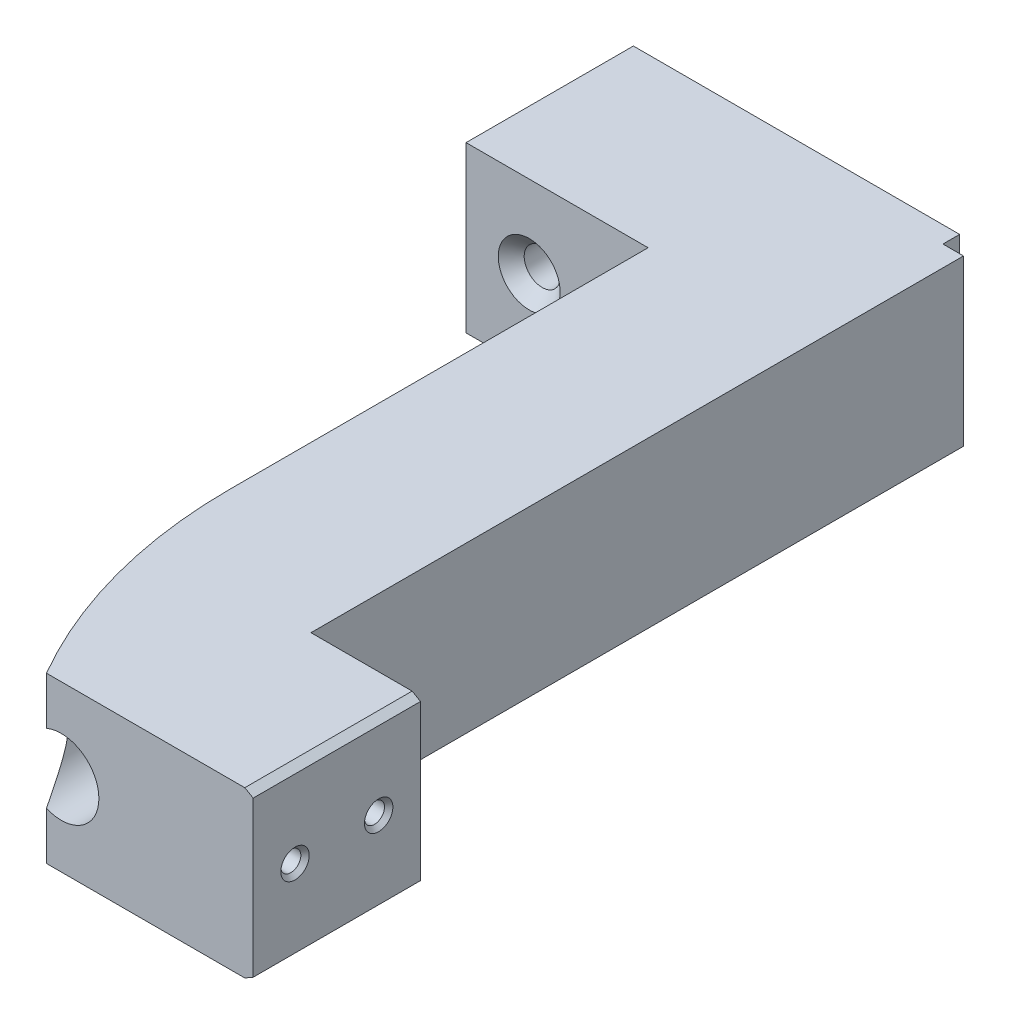
ISO-10303-21;
HEADER;
FILE_DESCRIPTION(('STEP AP214'),'2;1');
FILE_NAME('part.step','',(''),(''),'','','');
FILE_SCHEMA(('AUTOMOTIVE_DESIGN { 1 0 10303 214 1 1 1 1 }'));
ENDSEC;
DATA;
#1=APPLICATION_CONTEXT('core data for automotive mechanical design processes');
#2=APPLICATION_PROTOCOL_DEFINITION('international standard','automotive_design',2000,#1);
#3=PRODUCT_CONTEXT('',#1,'mechanical');
#4=PRODUCT('Part','Part','',(#3));
#5=PRODUCT_RELATED_PRODUCT_CATEGORY('part','',(#4));
#6=PRODUCT_DEFINITION_FORMATION('','',#4);
#7=PRODUCT_DEFINITION_CONTEXT('part definition',#1,'design');
#8=PRODUCT_DEFINITION('design','',#6,#7);
#9=PRODUCT_DEFINITION_SHAPE('','',#8);
#10=(LENGTH_UNIT() NAMED_UNIT(*) SI_UNIT(.MILLI.,.METRE.));
#11=(NAMED_UNIT(*) PLANE_ANGLE_UNIT() SI_UNIT($,.RADIAN.));
#12=(NAMED_UNIT(*) SI_UNIT($,.STERADIAN.) SOLID_ANGLE_UNIT());
#13=UNCERTAINTY_MEASURE_WITH_UNIT(LENGTH_MEASURE(1.E-05),#10,'distance_accuracy_value','');
#14=(GEOMETRIC_REPRESENTATION_CONTEXT(3) GLOBAL_UNCERTAINTY_ASSIGNED_CONTEXT((#13)) GLOBAL_UNIT_ASSIGNED_CONTEXT((#10,
#11,#12)) REPRESENTATION_CONTEXT('',''));
#15=CARTESIAN_POINT('',(0.,0.,0.));
#16=DIRECTION('',(0.,0.,1.));
#17=DIRECTION('',(1.,0.,0.));
#18=AXIS2_PLACEMENT_3D('',#15,#16,#17);
#19=CARTESIAN_POINT('',(41.4630883490828,0.,100.));
#20=DIRECTION('',(-1.,0.,0.));
#21=DIRECTION('',(0.,0.,1.));
#22=AXIS2_PLACEMENT_3D('',#19,#20,#21);
#23=PLANE('',#22);
#24=DIRECTION('',(0.,1.,0.));
#25=VECTOR('',#24,1.);
#26=CARTESIAN_POINT('',(41.4630883490828,19.7,80.));
#27=LINE('',#26,#25);
#28=CARTESIAN_POINT('',(41.4630883490828,0.,80.));
#29=VERTEX_POINT('',#28);
#30=CARTESIAN_POINT('',(41.4630883490828,19.7,80.));
#31=VERTEX_POINT('',#30);
#32=EDGE_CURVE('E171',#29,#31,#27,.T.);
#33=ORIENTED_EDGE('',*,*,#32,.F.);
#34=DIRECTION('',(0.,0.,-1.));
#35=VECTOR('',#34,1.);
#36=CARTESIAN_POINT('',(41.4630883490828,0.,100.));
#37=LINE('',#36,#35);
#38=CARTESIAN_POINT('',(41.4630883490828,0.,2.));
#39=VERTEX_POINT('',#38);
#40=EDGE_CURVE('E351',#29,#39,#37,.T.);
#41=ORIENTED_EDGE('',*,*,#40,.T.);
#42=DIRECTION('',(0.,-1.,0.));
#43=VECTOR('',#42,1.);
#44=CARTESIAN_POINT('',(41.4630883490828,19.7,2.));
#45=LINE('',#44,#43);
#46=CARTESIAN_POINT('',(41.4630883490828,19.7,2.));
#47=VERTEX_POINT('',#46);
#48=EDGE_CURVE('E374',#47,#39,#45,.T.);
#49=ORIENTED_EDGE('',*,*,#48,.F.);
#50=DIRECTION('',(0.,0.,-1.));
#51=VECTOR('',#50,1.);
#52=CARTESIAN_POINT('',(41.4630883490828,19.7,100.));
#53=LINE('',#52,#51);
#54=EDGE_CURVE('E353',#31,#47,#53,.T.);
#55=ORIENTED_EDGE('',*,*,#54,.F.);
#56=EDGE_LOOP('',(#33,#41,#49,#55));
#57=FACE_BOUND('',#56,.T.);
#58=ADVANCED_FACE('F38',(#57),#23,.F.);
#59=CARTESIAN_POINT('',(39.,0.,20.));
#60=DIRECTION('',(-1.,0.,0.));
#61=DIRECTION('',(0.,0.,1.));
#62=AXIS2_PLACEMENT_3D('',#59,#60,#61);
#63=PLANE('',#62);
#64=DIRECTION('',(0.,1.,0.));
#65=VECTOR('',#64,1.);
#66=CARTESIAN_POINT('',(39.,19.7,2.));
#67=LINE('',#66,#65);
#68=CARTESIAN_POINT('',(39.,0.,2.));
#69=VERTEX_POINT('',#68);
#70=CARTESIAN_POINT('',(39.,19.7,2.));
#71=VERTEX_POINT('',#70);
#72=EDGE_CURVE('E202',#69,#71,#67,.T.);
#73=ORIENTED_EDGE('',*,*,#72,.F.);
#74=DIRECTION('',(0.,0.,-1.));
#75=VECTOR('',#74,1.);
#76=CARTESIAN_POINT('',(39.,0.,20.));
#77=LINE('',#76,#75);
#78=CARTESIAN_POINT('',(39.,0.,0.));
#79=VERTEX_POINT('',#78);
#80=EDGE_CURVE('E307',#69,#79,#77,.T.);
#81=ORIENTED_EDGE('',*,*,#80,.T.);
#82=DIRECTION('',(0.,1.,0.));
#83=VECTOR('',#82,1.);
#84=CARTESIAN_POINT('',(39.,0.,0.));
#85=LINE('',#84,#83);
#86=CARTESIAN_POINT('',(39.,19.7,0.));
#87=VERTEX_POINT('',#86);
#88=EDGE_CURVE('E318',#79,#87,#85,.T.);
#89=ORIENTED_EDGE('',*,*,#88,.T.);
#90=DIRECTION('',(0.,0.,-1.));
#91=VECTOR('',#90,1.);
#92=CARTESIAN_POINT('',(39.,19.7,20.));
#93=LINE('',#92,#91);
#94=EDGE_CURVE('E309',#71,#87,#93,.T.);
#95=ORIENTED_EDGE('',*,*,#94,.F.);
#96=EDGE_LOOP('',(#73,#81,#89,#95));
#97=FACE_BOUND('',#96,.T.);
#98=ADVANCED_FACE('F227',(#97),#63,.F.);
#99=CARTESIAN_POINT('',(0.,0.,20.));
#100=DIRECTION('',(0.,0.,-1.));
#101=DIRECTION('',(-1.,0.,0.));
#102=AXIS2_PLACEMENT_3D('',#99,#100,#101);
#103=PLANE('',#102);
#104=CARTESIAN_POINT('',(7.55,9.85,20.));
#105=DIRECTION('',(0.,0.,1.));
#106=DIRECTION('',(1.,0.,0.));
#107=AXIS2_PLACEMENT_3D('',#104,#105,#106);
#108=CIRCLE('',#107,3.7);
#109=CARTESIAN_POINT('',(11.25,9.85,20.));
#110=VERTEX_POINT('',#109);
#111=EDGE_CURVE('E348',#110,#110,#108,.T.);
#112=ORIENTED_EDGE('',*,*,#111,.F.);
#113=EDGE_LOOP('',(#112));
#114=FACE_BOUND('',#113,.T.);
#115=DIRECTION('',(1.,0.,0.));
#116=VECTOR('',#115,1.);
#117=CARTESIAN_POINT('',(0.,0.,20.));
#118=LINE('',#117,#116);
#119=CARTESIAN_POINT('',(0.,0.,20.));
#120=VERTEX_POINT('',#119);
#121=CARTESIAN_POINT('',(21.7630883490828,0.,20.));
#122=VERTEX_POINT('',#121);
#123=EDGE_CURVE('E329',#120,#122,#118,.T.);
#124=ORIENTED_EDGE('',*,*,#123,.T.);
#125=DIRECTION('',(0.,1.,0.));
#126=VECTOR('',#125,1.);
#127=CARTESIAN_POINT('',(21.7630883490828,0.,20.));
#128=LINE('',#127,#126);
#129=CARTESIAN_POINT('',(21.7630883490828,19.7,20.));
#130=VERTEX_POINT('',#129);
#131=EDGE_CURVE('E364',#122,#130,#128,.T.);
#132=ORIENTED_EDGE('',*,*,#131,.T.);
#133=DIRECTION('',(-1.,0.,0.));
#134=VECTOR('',#133,1.);
#135=CARTESIAN_POINT('',(0.,19.7,20.));
#136=LINE('',#135,#134);
#137=CARTESIAN_POINT('',(0.,19.7,20.));
#138=VERTEX_POINT('',#137);
#139=EDGE_CURVE('E314',#130,#138,#136,.T.);
#140=ORIENTED_EDGE('',*,*,#139,.T.);
#141=DIRECTION('',(0.,-1.,0.));
#142=VECTOR('',#141,1.);
#143=CARTESIAN_POINT('',(0.,0.,20.));
#144=LINE('',#143,#142);
#145=EDGE_CURVE('E317',#138,#120,#144,.T.);
#146=ORIENTED_EDGE('',*,*,#145,.T.);
#147=EDGE_LOOP('',(#124,#132,#140,#146));
#148=FACE_BOUND('',#147,.T.);
#149=ADVANCED_FACE('F233',(#114,#148),#103,.F.);
#150=CARTESIAN_POINT('',(31.6130883490828,9.85,20.));
#151=DIRECTION('',(0.,0.,1.));
#152=DIRECTION('',(1.,0.,0.));
#153=AXIS2_PLACEMENT_3D('',#150,#151,#152);
#154=CIRCLE('',#153,3.7);
#155=CARTESIAN_POINT('',(35.3130883490828,9.85,20.));
#156=VERTEX_POINT('',#155);
#157=EDGE_CURVE('E339',#156,#156,#154,.T.);
#158=ORIENTED_EDGE('',*,*,#157,.F.);
#159=EDGE_LOOP('',(#158));
#160=FACE_BOUND('',#159,.T.);
#161=CARTESIAN_POINT('',(31.6130883490828,9.85,20.));
#162=DIRECTION('',(0.,0.,1.));
#163=DIRECTION('',(1.,0.,0.));
#164=AXIS2_PLACEMENT_3D('',#161,#162,#163);
#165=CIRCLE('',#164,4.5);
#166=CARTESIAN_POINT('',(36.1130883490828,9.85,20.));
#167=VERTEX_POINT('',#166);
#168=EDGE_CURVE('E360',#167,#167,#165,.T.);
#169=ORIENTED_EDGE('',*,*,#168,.T.);
#170=EDGE_LOOP('',(#169));
#171=FACE_BOUND('',#170,.T.);
#172=ADVANCED_FACE('F257',(#160,#171),#103,.F.);
#173=CARTESIAN_POINT('',(0.,0.,20.));
#174=DIRECTION('',(1.,0.,0.));
#175=DIRECTION('',(0.,0.,-1.));
#176=AXIS2_PLACEMENT_3D('',#173,#174,#175);
#177=PLANE('',#176);
#178=DIRECTION('',(0.,-1.,0.));
#179=VECTOR('',#178,1.);
#180=CARTESIAN_POINT('',(0.,0.,0.));
#181=LINE('',#180,#179);
#182=CARTESIAN_POINT('',(0.,19.7,0.));
#183=VERTEX_POINT('',#182);
#184=CARTESIAN_POINT('',(0.,0.,0.));
#185=VERTEX_POINT('',#184);
#186=EDGE_CURVE('E324',#183,#185,#181,.T.);
#187=ORIENTED_EDGE('',*,*,#186,.T.);
#188=DIRECTION('',(0.,0.,-1.));
#189=VECTOR('',#188,1.);
#190=CARTESIAN_POINT('',(0.,0.,20.));
#191=LINE('',#190,#189);
#192=EDGE_CURVE('E304',#120,#185,#191,.T.);
#193=ORIENTED_EDGE('',*,*,#192,.F.);
#194=ORIENTED_EDGE('',*,*,#145,.F.);
#195=DIRECTION('',(0.,0.,-1.));
#196=VECTOR('',#195,1.);
#197=CARTESIAN_POINT('',(0.,19.7,20.));
#198=LINE('',#197,#196);
#199=EDGE_CURVE('E311',#138,#183,#198,.T.);
#200=ORIENTED_EDGE('',*,*,#199,.T.);
#201=EDGE_LOOP('',(#187,#193,#194,#200));
#202=FACE_BOUND('',#201,.T.);
#203=ADVANCED_FACE('F269',(#202),#177,.F.);
#204=CARTESIAN_POINT('',(0.,0.,20.));
#205=DIRECTION('',(0.,1.,0.));
#206=DIRECTION('',(0.,0.,1.));
#207=AXIS2_PLACEMENT_3D('',#204,#205,#206);
#208=PLANE('',#207);
#209=DIRECTION('',(-1.,0.,0.));
#210=VECTOR('',#209,1.);
#211=CARTESIAN_POINT('',(54.5530883490828,0.,80.));
#212=LINE('',#211,#210);
#213=CARTESIAN_POINT('',(53.5530883490828,0.,80.));
#214=VERTEX_POINT('',#213);
#215=EDGE_CURVE('E182',#214,#29,#212,.T.);
#216=ORIENTED_EDGE('',*,*,#215,.F.);
#217=DIRECTION('',(0.,0.,1.));
#218=VECTOR('',#217,1.);
#219=CARTESIAN_POINT('',(53.5530883490828,0.,100.));
#220=LINE('',#219,#218);
#221=CARTESIAN_POINT('',(53.5530883490828,0.,100.));
#222=VERTEX_POINT('',#221);
#223=EDGE_CURVE('E62',#214,#222,#220,.T.);
#224=ORIENTED_EDGE('',*,*,#223,.T.);
#225=DIRECTION('',(1.,0.,0.));
#226=VECTOR('',#225,1.);
#227=CARTESIAN_POINT('',(0.,0.,100.));
#228=LINE('',#227,#226);
#229=CARTESIAN_POINT('',(29.8482648969,0.,100.));
#230=VERTEX_POINT('',#229);
#231=EDGE_CURVE('E363',#230,#222,#228,.T.);
#232=ORIENTED_EDGE('',*,*,#231,.F.);
#233=CARTESIAN_POINT('',(81.4630883490828,0.,70.));
#234=DIRECTION('',(0.,-1.,0.));
#235=DIRECTION('',(0.,0.,1.));
#236=AXIS2_PLACEMENT_3D('',#233,#234,#235);
#237=CIRCLE('',#236,59.7);
#238=CARTESIAN_POINT('',(21.7630883490828,0.,70.));
#239=VERTEX_POINT('',#238);
#240=EDGE_CURVE('E185',#230,#239,#237,.T.);
#241=ORIENTED_EDGE('',*,*,#240,.T.);
#242=DIRECTION('',(0.,0.,-1.));
#243=VECTOR('',#242,1.);
#244=CARTESIAN_POINT('',(21.7630883490828,0.,100.));
#245=LINE('',#244,#243);
#246=EDGE_CURVE('E357',#239,#122,#245,.T.);
#247=ORIENTED_EDGE('',*,*,#246,.T.);
#248=ORIENTED_EDGE('',*,*,#123,.F.);
#249=ORIENTED_EDGE('',*,*,#192,.T.);
#250=DIRECTION('',(1.,0.,0.));
#251=VECTOR('',#250,1.);
#252=CARTESIAN_POINT('',(0.,0.,0.));
#253=LINE('',#252,#251);
#254=EDGE_CURVE('E321',#185,#79,#253,.T.);
#255=ORIENTED_EDGE('',*,*,#254,.T.);
#256=ORIENTED_EDGE('',*,*,#80,.F.);
#257=DIRECTION('',(-1.,0.,0.));
#258=VECTOR('',#257,1.);
#259=CARTESIAN_POINT('',(39.,0.,2.));
#260=LINE('',#259,#258);
#261=EDGE_CURVE('E367',#39,#69,#260,.T.);
#262=ORIENTED_EDGE('',*,*,#261,.F.);
#263=ORIENTED_EDGE('',*,*,#40,.F.);
#264=EDGE_LOOP('',(#216,#224,#232,#241,#247,#248,#249,#255,#256,#262,#263));
#265=FACE_BOUND('',#264,.T.);
#266=ADVANCED_FACE('F264',(#265),#208,.F.);
#267=CARTESIAN_POINT('',(0.,19.7,20.));
#268=DIRECTION('',(0.,-1.,0.));
#269=DIRECTION('',(0.,0.,-1.));
#270=AXIS2_PLACEMENT_3D('',#267,#268,#269);
#271=PLANE('',#270);
#272=DIRECTION('',(-1.,0.,0.));
#273=VECTOR('',#272,1.);
#274=CARTESIAN_POINT('',(0.,19.7,100.));
#275=LINE('',#274,#273);
#276=CARTESIAN_POINT('',(53.5530883490828,19.7,100.));
#277=VERTEX_POINT('',#276);
#278=CARTESIAN_POINT('',(29.8482648969,19.7,100.));
#279=VERTEX_POINT('',#278);
#280=EDGE_CURVE('E370',#277,#279,#275,.T.);
#281=ORIENTED_EDGE('',*,*,#280,.F.);
#282=DIRECTION('',(0.,0.,-1.));
#283=VECTOR('',#282,1.);
#284=CARTESIAN_POINT('',(53.5530883490828,19.7,80.));
#285=LINE('',#284,#283);
#286=CARTESIAN_POINT('',(53.5530883490828,19.7,80.));
#287=VERTEX_POINT('',#286);
#288=EDGE_CURVE('E11',#277,#287,#285,.T.);
#289=ORIENTED_EDGE('',*,*,#288,.T.);
#290=DIRECTION('',(-1.,0.,0.));
#291=VECTOR('',#290,1.);
#292=CARTESIAN_POINT('',(54.5530883490828,19.7,80.));
#293=LINE('',#292,#291);
#294=EDGE_CURVE('E178',#287,#31,#293,.T.);
#295=ORIENTED_EDGE('',*,*,#294,.T.);
#296=ORIENTED_EDGE('',*,*,#54,.T.);
#297=DIRECTION('',(1.,0.,0.));
#298=VECTOR('',#297,1.);
#299=CARTESIAN_POINT('',(39.,19.7,2.));
#300=LINE('',#299,#298);
#301=EDGE_CURVE('E376',#71,#47,#300,.T.);
#302=ORIENTED_EDGE('',*,*,#301,.F.);
#303=ORIENTED_EDGE('',*,*,#94,.T.);
#304=DIRECTION('',(-1.,0.,0.));
#305=VECTOR('',#304,1.);
#306=CARTESIAN_POINT('',(0.,19.7,0.));
#307=LINE('',#306,#305);
#308=EDGE_CURVE('E315',#87,#183,#307,.T.);
#309=ORIENTED_EDGE('',*,*,#308,.T.);
#310=ORIENTED_EDGE('',*,*,#199,.F.);
#311=ORIENTED_EDGE('',*,*,#139,.F.);
#312=DIRECTION('',(0.,0.,-1.));
#313=VECTOR('',#312,1.);
#314=CARTESIAN_POINT('',(21.7630883490828,19.7,100.));
#315=LINE('',#314,#313);
#316=CARTESIAN_POINT('',(21.7630883490828,19.7,70.));
#317=VERTEX_POINT('',#316);
#318=EDGE_CURVE('E355',#317,#130,#315,.T.);
#319=ORIENTED_EDGE('',*,*,#318,.F.);
#320=CARTESIAN_POINT('',(81.4630883490828,19.7,70.));
#321=DIRECTION('',(0.,-1.,0.));
#322=DIRECTION('',(0.,0.,1.));
#323=AXIS2_PLACEMENT_3D('',#320,#321,#322);
#324=CIRCLE('',#323,59.7);
#325=EDGE_CURVE('E184',#279,#317,#324,.T.);
#326=ORIENTED_EDGE('',*,*,#325,.F.);
#327=EDGE_LOOP('',(#281,#289,#295,#296,#302,#303,#309,#310,#311,#319,#326));
#328=FACE_BOUND('',#327,.T.);
#329=ADVANCED_FACE('F261',(#328),#271,.F.);
#330=CARTESIAN_POINT('',(0.,0.,0.));
#331=DIRECTION('',(0.,0.,-1.));
#332=DIRECTION('',(-1.,0.,0.));
#333=AXIS2_PLACEMENT_3D('',#330,#331,#332);
#334=PLANE('',#333);
#335=CARTESIAN_POINT('',(7.55,9.85,0.));
#336=DIRECTION('',(0.,0.,-1.));
#337=DIRECTION('',(-1.,0.,0.));
#338=AXIS2_PLACEMENT_3D('',#335,#336,#337);
#339=CIRCLE('',#338,2.14999999999999);
#340=CARTESIAN_POINT('',(5.40000000000001,9.85,0.));
#341=VERTEX_POINT('',#340);
#342=EDGE_CURVE('E342',#341,#341,#339,.T.);
#343=ORIENTED_EDGE('',*,*,#342,.F.);
#344=EDGE_LOOP('',(#343));
#345=FACE_BOUND('',#344,.T.);
#346=CARTESIAN_POINT('',(31.6130883490828,9.85,0.));
#347=DIRECTION('',(0.,0.,-1.));
#348=DIRECTION('',(-1.,0.,0.));
#349=AXIS2_PLACEMENT_3D('',#346,#347,#348);
#350=CIRCLE('',#349,2.14999999999999);
#351=CARTESIAN_POINT('',(29.4630883490828,9.85,0.));
#352=VERTEX_POINT('',#351);
#353=EDGE_CURVE('E327',#352,#352,#350,.T.);
#354=ORIENTED_EDGE('',*,*,#353,.F.);
#355=EDGE_LOOP('',(#354));
#356=FACE_BOUND('',#355,.T.);
#357=ORIENTED_EDGE('',*,*,#186,.F.);
#358=ORIENTED_EDGE('',*,*,#308,.F.);
#359=ORIENTED_EDGE('',*,*,#88,.F.);
#360=ORIENTED_EDGE('',*,*,#254,.F.);
#361=EDGE_LOOP('',(#357,#358,#359,#360));
#362=FACE_BOUND('',#361,.T.);
#363=ADVANCED_FACE('F253',(#345,#356,#362),#334,.T.);
#364=CARTESIAN_POINT('',(31.6130883490828,9.85,20.));
#365=DIRECTION('',(0.,0.,1.));
#366=DIRECTION('',(1.,0.,0.));
#367=AXIS2_PLACEMENT_3D('',#364,#365,#366);
#368=CYLINDRICAL_SURFACE('',#367,2.14999999999999);
#369=CARTESIAN_POINT('',(31.6130883490828,9.85,18.45));
#370=DIRECTION('',(0.,0.,1.));
#371=DIRECTION('',(1.,0.,0.));
#372=AXIS2_PLACEMENT_3D('',#369,#370,#371);
#373=CIRCLE('',#372,2.14999999999999);
#374=CARTESIAN_POINT('',(33.7630883490828,9.85,18.45));
#375=VERTEX_POINT('',#374);
#376=EDGE_CURVE('E336',#375,#375,#373,.T.);
#377=ORIENTED_EDGE('',*,*,#376,.T.);
#378=EDGE_LOOP('',(#377));
#379=FACE_BOUND('',#378,.T.);
#380=ORIENTED_EDGE('',*,*,#353,.T.);
#381=EDGE_LOOP('',(#380));
#382=FACE_BOUND('',#381,.T.);
#383=ADVANCED_FACE('F249',(#379,#382),#368,.F.);
#384=CARTESIAN_POINT('',(31.6130883490828,9.85,20.));
#385=DIRECTION('',(0.,0.,1.));
#386=DIRECTION('',(1.,0.,0.));
#387=AXIS2_PLACEMENT_3D('',#384,#385,#386);
#388=CONICAL_SURFACE('',#387,3.7,0.785398163397447);
#389=ORIENTED_EDGE('',*,*,#376,.F.);
#390=EDGE_LOOP('',(#389));
#391=FACE_BOUND('',#390,.T.);
#392=ORIENTED_EDGE('',*,*,#157,.T.);
#393=EDGE_LOOP('',(#392));
#394=FACE_BOUND('',#393,.T.);
#395=ADVANCED_FACE('F245',(#391,#394),#388,.F.);
#396=CARTESIAN_POINT('',(7.55,9.85,20.));
#397=DIRECTION('',(0.,0.,1.));
#398=DIRECTION('',(1.,0.,0.));
#399=AXIS2_PLACEMENT_3D('',#396,#397,#398);
#400=CYLINDRICAL_SURFACE('',#399,2.14999999999999);
#401=CARTESIAN_POINT('',(7.55,9.85,18.45));
#402=DIRECTION('',(0.,0.,1.));
#403=DIRECTION('',(1.,0.,0.));
#404=AXIS2_PLACEMENT_3D('',#401,#402,#403);
#405=CIRCLE('',#404,2.14999999999999);
#406=CARTESIAN_POINT('',(9.69999999999999,9.85,18.45));
#407=VERTEX_POINT('',#406);
#408=EDGE_CURVE('E345',#407,#407,#405,.T.);
#409=ORIENTED_EDGE('',*,*,#408,.T.);
#410=EDGE_LOOP('',(#409));
#411=FACE_BOUND('',#410,.T.);
#412=ORIENTED_EDGE('',*,*,#342,.T.);
#413=EDGE_LOOP('',(#412));
#414=FACE_BOUND('',#413,.T.);
#415=ADVANCED_FACE('F241',(#411,#414),#400,.F.);
#416=CARTESIAN_POINT('',(7.55,9.85,20.));
#417=DIRECTION('',(0.,0.,1.));
#418=DIRECTION('',(1.,0.,0.));
#419=AXIS2_PLACEMENT_3D('',#416,#417,#418);
#420=CONICAL_SURFACE('',#419,3.7,0.785398163397447);
#421=ORIENTED_EDGE('',*,*,#408,.F.);
#422=EDGE_LOOP('',(#421));
#423=FACE_BOUND('',#422,.T.);
#424=ORIENTED_EDGE('',*,*,#111,.T.);
#425=EDGE_LOOP('',(#424));
#426=FACE_BOUND('',#425,.T.);
#427=ADVANCED_FACE('F238',(#423,#426),#420,.F.);
#428=CARTESIAN_POINT('',(21.7630883490828,0.,100.));
#429=DIRECTION('',(-1.,0.,0.));
#430=DIRECTION('',(0.,-1.,0.));
#431=AXIS2_PLACEMENT_3D('',#428,#429,#430);
#432=PLANE('',#431);
#433=DIRECTION('',(0.,1.,0.));
#434=VECTOR('',#433,1.);
#435=CARTESIAN_POINT('',(21.7630883490828,0.,70.));
#436=LINE('',#435,#434);
#437=EDGE_CURVE('E188',#239,#317,#436,.T.);
#438=ORIENTED_EDGE('',*,*,#437,.T.);
#439=ORIENTED_EDGE('',*,*,#318,.T.);
#440=ORIENTED_EDGE('',*,*,#131,.F.);
#441=ORIENTED_EDGE('',*,*,#246,.F.);
#442=EDGE_LOOP('',(#438,#439,#440,#441));
#443=FACE_BOUND('',#442,.T.);
#444=ADVANCED_FACE('F224',(#443),#432,.T.);
#445=CARTESIAN_POINT('',(31.6130883490828,9.85,100.));
#446=DIRECTION('',(0.,0.,-1.));
#447=DIRECTION('',(-1.,0.,0.));
#448=AXIS2_PLACEMENT_3D('',#445,#446,#447);
#449=CYLINDRICAL_SURFACE('',#448,4.5);
#450=CARTESIAN_POINT('',(29.8482648969,5.71050749697193,100.));
#451=CARTESIAN_POINT('',(29.7573327363336,5.7492915407916,99.8435552754339));
#452=CARTESIAN_POINT('',(29.6674409236068,5.79114176766117,99.6872563227438));
#453=CARTESIAN_POINT('',(29.4898253914112,5.88115816776018,99.3751956909919));
#454=CARTESIAN_POINT('',(29.4021021923884,5.92932583995793,99.2194341484741));
#455=CARTESIAN_POINT('',(29.2282246339589,6.03257590888257,98.9074589558449));
#456=CARTESIAN_POINT('',(29.1420897398109,6.08771318552003,98.751252567854));
#457=CARTESIAN_POINT('',(28.9723027890027,6.20488088465941,98.4400920503629));
#458=CARTESIAN_POINT('',(28.8886505399666,6.26691077128805,98.2851378245154));
#459=CARTESIAN_POINT('',(28.7193796971349,6.40198222782546,97.9682898151554));
#460=CARTESIAN_POINT('',(28.6339135927179,6.47544607504424,97.8064937345288));
#461=CARTESIAN_POINT('',(28.4662161839201,6.63125815418113,97.485529134678));
#462=CARTESIAN_POINT('',(28.3839844993272,6.71360533756157,97.3263603078997));
#463=CARTESIAN_POINT('',(28.2234043689128,6.88789912777069,97.0121652034036));
#464=CARTESIAN_POINT('',(28.1450437952242,6.97981252481124,96.8571267957874));
#465=CARTESIAN_POINT('',(27.9925113182906,7.17478901833796,96.5521448725778));
#466=CARTESIAN_POINT('',(27.9183368149126,7.27784507504326,96.4021982178754));
#467=CARTESIAN_POINT('',(27.8013576571921,7.45676902438222,96.1633200516963));
#468=CARTESIAN_POINT('',(27.7570350095204,7.52872552964363,96.0722011843658));
#469=CARTESIAN_POINT('',(27.6707330123241,7.67852229353251,95.8936735032703));
#470=CARTESIAN_POINT('',(27.6287544380072,7.75636447881049,95.806265919126));
#471=CARTESIAN_POINT('',(27.547942981744,7.91798230196027,95.6370010439462));
#472=CARTESIAN_POINT('',(27.5090878567034,8.00170617277274,95.5551053405366));
#473=CARTESIAN_POINT('',(27.4348276184277,8.17634137740738,95.3977283510213));
#474=CARTESIAN_POINT('',(27.3994199901016,8.26724738251887,95.322242393962));
#475=CARTESIAN_POINT('',(27.3295417793218,8.46670405630051,95.1725369611513));
#476=CARTESIAN_POINT('',(27.2955302221009,8.57610920691733,95.0992219459865));
#477=CARTESIAN_POINT('',(27.2344499816235,8.80523458861749,94.966980082151));
#478=CARTESIAN_POINT('',(27.2073761634249,8.92494710255227,94.9080425935674));
#479=CARTESIAN_POINT('',(27.1660948184226,9.15331107291617,94.8179078929222));
#480=CARTESIAN_POINT('',(27.1504993462804,9.26051320716756,94.7837336977656));
#481=CARTESIAN_POINT('',(27.1270011519775,9.47969808522657,94.7321744532177));
#482=CARTESIAN_POINT('',(27.1190896278567,9.5916752053654,94.7147701940513));
#483=CARTESIAN_POINT('',(27.1117775650123,9.81779595809533,94.6986863909995));
#484=CARTESIAN_POINT('',(27.1124151908843,9.93194703248659,94.700090811647));
#485=CARTESIAN_POINT('',(27.1222172442084,10.1580937449164,94.7216473779651));
#486=CARTESIAN_POINT('',(27.1313875657166,10.2700878384085,94.7418124827895));
#487=CARTESIAN_POINT('',(27.1595770442737,10.5080421275882,94.8036284545964));
#488=CARTESIAN_POINT('',(27.1800451437581,10.6329927377044,94.848435327978));
#489=CARTESIAN_POINT('',(27.2292597122891,10.8733215293115,94.9556661641982));
#490=CARTESIAN_POINT('',(27.2580220596402,10.9886807984308,95.0181239128091));
#491=CARTESIAN_POINT('',(27.3155020506295,11.1876303397287,95.1422478222525));
#492=CARTESIAN_POINT('',(27.3431113300617,11.2730009950482,95.2016440346989));
#493=CARTESIAN_POINT('',(27.401594416458,11.4377548075694,95.3268562670323));
#494=CARTESIAN_POINT('',(27.4324703622868,11.5171339828207,95.3926764908569));
#495=CARTESIAN_POINT('',(27.4969291960199,11.6704854238026,95.5293828491457));
#496=CARTESIAN_POINT('',(27.5305172664823,11.7444467968546,95.6002786516931));
#497=CARTESIAN_POINT('',(27.5999147928075,11.8873363530193,95.745971822588));
#498=CARTESIAN_POINT('',(27.6357251181799,11.9562625427386,95.820770716267));
#499=CARTESIAN_POINT('',(27.7461035489741,12.1564582135005,96.0500334254643));
#500=CARTESIAN_POINT('',(27.8235058814967,12.2808847902669,96.2091223350988));
#501=CARTESIAN_POINT('',(27.984103707863,12.5146879926519,96.535285717438));
#502=CARTESIAN_POINT('',(28.067305018983,12.624049168333,96.7023681546488));
#503=CARTESIAN_POINT('',(28.2387247566534,12.8302159168065,97.0424387627452));
#504=CARTESIAN_POINT('',(28.3269582797465,12.9269805056485,97.2154440064317));
#505=CARTESIAN_POINT('',(28.5075137432614,13.1091154024648,97.5651200569947));
#506=CARTESIAN_POINT('',(28.5998339943127,13.1944903611707,97.7417893334752));
#507=CARTESIAN_POINT('',(28.7845880221157,13.3519630993275,98.0909795101427));
#508=CARTESIAN_POINT('',(28.8768836995535,13.4244425815519,98.2634023199366));
#509=CARTESIAN_POINT('',(29.0646441117961,13.5606439761076,98.6099965420983));
#510=CARTESIAN_POINT('',(29.1601092942212,13.6243646448679,98.7841681990072));
#511=CARTESIAN_POINT('',(29.3528267023257,13.7427967380289,99.1315910758218));
#512=CARTESIAN_POINT('',(29.4500436761449,13.7976072082317,99.3048282119902));
#513=CARTESIAN_POINT('',(29.6471672056533,13.8993698039777,99.6519852826469));
#514=CARTESIAN_POINT('',(29.7470726888689,13.9463250106639,99.825904921905));
#515=CARTESIAN_POINT('',(29.8482648969,13.9894925030281,100.));
#516=B_SPLINE_CURVE_WITH_KNOTS('',3,(#450,#451,#452,#453,#454,#455,#456,#457,#458,#459,#460,
#461,#462,#463,#464,#465,#466,#467,#468,#469,#470,#471,#472,#473,#474,#475,#476,#477,#478,#479,
#480,#481,#482,#483,#484,#485,#486,#487,#488,#489,#490,#491,#492,#493,#494,#495,#496,#497,#498,
#499,#500,#501,#502,#503,#504,#505,#506,#507,#508,#509,#510,#511,#512,#513,#514,#515),
.UNSPECIFIED.,.F.,.F.,(4,2,2,2,2,2,2,2,2,2,2,2,2,2,2,2,2,2,2,2,2,2,2,2,2,2,2,2,2,2,2,2,4),(0.,
0.555168391350228,1.11046874908873,1.67045136382442,2.2303904725393,2.8217066787929,
3.41295316570818,4.00221154694249,4.59109979438234,4.96375761263321,5.33653795129814,
5.70637152204132,6.07593322991741,6.48296617143082,6.88969697312685,7.22909999540423,
7.56811377146598,7.90864145419468,8.24940453503838,8.65012170622785,9.05161115183221,
9.37397400146308,9.6965492414016,10.0197561755412,10.343090379268,10.9908686690053,
11.6393064030024,12.2898037823468,12.9400347255226,13.5655136206015,14.1910812292628,
14.8091327718262,15.4269413189816),.UNSPECIFIED.);
#517=CARTESIAN_POINT('',(29.8482648969,5.71050749697193,100.));
#518=VERTEX_POINT('',#517);
#519=CARTESIAN_POINT('',(29.8482648969,13.9894925030281,100.));
#520=VERTEX_POINT('',#519);
#521=EDGE_CURVE('E192',#518,#520,#516,.T.);
#522=ORIENTED_EDGE('',*,*,#521,.F.);
#523=CARTESIAN_POINT('',(31.6130883490828,9.85,100.));
#524=DIRECTION('',(0.,0.,1.));
#525=DIRECTION('',(1.,0.,0.));
#526=AXIS2_PLACEMENT_3D('',#523,#524,#525);
#527=CIRCLE('',#526,4.5);
#528=EDGE_CURVE('E359',#518,#520,#527,.T.);
#529=ORIENTED_EDGE('',*,*,#528,.T.);
#530=EDGE_LOOP('',(#522,#529));
#531=FACE_BOUND('',#530,.T.);
#532=ORIENTED_EDGE('',*,*,#168,.F.);
#533=EDGE_LOOP('',(#532));
#534=FACE_BOUND('',#533,.T.);
#535=ADVANCED_FACE('F204',(#531,#534),#449,.F.);
#536=CARTESIAN_POINT('',(0.,0.,100.));
#537=DIRECTION('',(0.,0.,1.));
#538=DIRECTION('',(1.,0.,0.));
#539=AXIS2_PLACEMENT_3D('',#536,#537,#538);
#540=PLANE('',#539);
#541=ORIENTED_EDGE('',*,*,#231,.T.);
#542=DIRECTION('',(0.866025403784442,0.499999999999995,0.));
#543=VECTOR('',#542,1.);
#544=CARTESIAN_POINT('',(13.3882720872704,-23.1891674807089,100.));
#545=LINE('',#544,#543);
#546=CARTESIAN_POINT('',(54.5530883490828,0.577350269189626,100.));
#547=VERTEX_POINT('',#546);
#548=EDGE_CURVE('E47',#222,#547,#545,.T.);
#549=ORIENTED_EDGE('',*,*,#548,.T.);
#550=DIRECTION('',(0.,-1.,0.));
#551=VECTOR('',#550,1.);
#552=CARTESIAN_POINT('',(54.5530883490828,19.7,100.));
#553=LINE('',#552,#551);
#554=CARTESIAN_POINT('',(54.5530883490828,19.1226497308104,100.));
#555=VERTEX_POINT('',#554);
#556=EDGE_CURVE('E172',#555,#547,#553,.T.);
#557=ORIENTED_EDGE('',*,*,#556,.F.);
#558=DIRECTION('',(-0.866025403784441,0.499999999999996,0.));
#559=VECTOR('',#558,1.);
#560=CARTESIAN_POINT('',(21.9186223145472,37.964167480709,100.));
#561=LINE('',#560,#559);
#562=EDGE_CURVE('E54',#555,#277,#561,.T.);
#563=ORIENTED_EDGE('',*,*,#562,.T.);
#564=ORIENTED_EDGE('',*,*,#280,.T.);
#565=DIRECTION('',(0.,1.,0.));
#566=VECTOR('',#565,1.);
#567=CARTESIAN_POINT('',(29.8482648969,0.,100.));
#568=LINE('',#567,#566);
#569=EDGE_CURVE('E301',#520,#279,#568,.T.);
#570=ORIENTED_EDGE('',*,*,#569,.F.);
#571=ORIENTED_EDGE('',*,*,#528,.F.);
#572=DIRECTION('',(0.,1.,0.));
#573=VECTOR('',#572,1.);
#574=CARTESIAN_POINT('',(29.8482648969,0.,100.));
#575=LINE('',#574,#573);
#576=EDGE_CURVE('E190',#230,#518,#575,.T.);
#577=ORIENTED_EDGE('',*,*,#576,.F.);
#578=EDGE_LOOP('',(#541,#549,#557,#563,#564,#570,#571,#577));
#579=FACE_BOUND('',#578,.T.);
#580=ADVANCED_FACE('F218',(#579),#540,.T.);
#581=CARTESIAN_POINT('',(0.,0.,2.));
#582=DIRECTION('',(0.,0.,1.));
#583=DIRECTION('',(1.,0.,0.));
#584=AXIS2_PLACEMENT_3D('',#581,#582,#583);
#585=PLANE('',#584);
#586=ORIENTED_EDGE('',*,*,#72,.T.);
#587=ORIENTED_EDGE('',*,*,#301,.T.);
#588=ORIENTED_EDGE('',*,*,#48,.T.);
#589=ORIENTED_EDGE('',*,*,#261,.T.);
#590=EDGE_LOOP('',(#586,#587,#588,#589));
#591=FACE_BOUND('',#590,.T.);
#592=ADVANCED_FACE('F214',(#591),#585,.F.);
#593=CARTESIAN_POINT('',(81.4630883490828,0.,70.));
#594=DIRECTION('',(0.,1.,0.));
#595=DIRECTION('',(0.,0.,1.));
#596=AXIS2_PLACEMENT_3D('',#593,#594,#595);
#597=CYLINDRICAL_SURFACE('',#596,59.7);
#598=ORIENTED_EDGE('',*,*,#521,.T.);
#599=ORIENTED_EDGE('',*,*,#569,.T.);
#600=ORIENTED_EDGE('',*,*,#325,.T.);
#601=ORIENTED_EDGE('',*,*,#437,.F.);
#602=ORIENTED_EDGE('',*,*,#240,.F.);
#603=ORIENTED_EDGE('',*,*,#576,.T.);
#604=EDGE_LOOP('',(#598,#599,#600,#601,#602,#603));
#605=FACE_BOUND('',#604,.T.);
#606=ADVANCED_FACE('F208',(#605),#597,.T.);
#607=CARTESIAN_POINT('',(54.5530883490828,19.7,80.));
#608=DIRECTION('',(0.,0.,1.));
#609=DIRECTION('',(1.,0.,0.));
#610=AXIS2_PLACEMENT_3D('',#607,#608,#609);
#611=PLANE('',#610);
#612=DIRECTION('',(0.,1.,0.));
#613=VECTOR('',#612,1.);
#614=CARTESIAN_POINT('',(54.5530883490828,19.7,80.));
#615=LINE('',#614,#613);
#616=CARTESIAN_POINT('',(54.5530883490828,0.577350269189626,80.));
#617=VERTEX_POINT('',#616);
#618=CARTESIAN_POINT('',(54.5530883490828,19.1226497308104,80.));
#619=VERTEX_POINT('',#618);
#620=EDGE_CURVE('E175',#617,#619,#615,.T.);
#621=ORIENTED_EDGE('',*,*,#620,.F.);
#622=DIRECTION('',(-0.866025403784442,-0.499999999999995,0.));
#623=VECTOR('',#622,1.);
#624=CARTESIAN_POINT('',(54.5530883490828,0.577350269189626,80.));
#625=LINE('',#624,#623);
#626=EDGE_CURVE('E293',#617,#214,#625,.T.);
#627=ORIENTED_EDGE('',*,*,#626,.T.);
#628=ORIENTED_EDGE('',*,*,#215,.T.);
#629=ORIENTED_EDGE('',*,*,#32,.T.);
#630=ORIENTED_EDGE('',*,*,#294,.F.);
#631=DIRECTION('',(0.866025403784441,-0.499999999999996,0.));
#632=VECTOR('',#631,1.);
#633=CARTESIAN_POINT('',(54.5530883490828,19.1226497308104,80.));
#634=LINE('',#633,#632);
#635=EDGE_CURVE('E295',#287,#619,#634,.T.);
#636=ORIENTED_EDGE('',*,*,#635,.T.);
#637=EDGE_LOOP('',(#621,#627,#628,#629,#630,#636));
#638=FACE_BOUND('',#637,.T.);
#639=ADVANCED_FACE('F213',(#638),#611,.F.);
#640=CARTESIAN_POINT('',(54.5530883490828,0.,0.));
#641=DIRECTION('',(1.,0.,0.));
#642=DIRECTION('',(0.,0.,-1.));
#643=AXIS2_PLACEMENT_3D('',#640,#641,#642);
#644=PLANE('',#643);
#645=CARTESIAN_POINT('',(54.5530883490828,9.85000000000001,95.));
#646=DIRECTION('',(1.,0.,0.));
#647=DIRECTION('',(0.,0.,-1.));
#648=AXIS2_PLACEMENT_3D('',#645,#646,#647);
#649=CIRCLE('',#648,1.7);
#650=CARTESIAN_POINT('',(54.5530883490828,9.85000000000001,93.3));
#651=VERTEX_POINT('',#650);
#652=EDGE_CURVE('E162',#651,#651,#649,.T.);
#653=ORIENTED_EDGE('',*,*,#652,.F.);
#654=EDGE_LOOP('',(#653));
#655=FACE_BOUND('',#654,.T.);
#656=CARTESIAN_POINT('',(54.5530883490828,9.85000000000001,85.));
#657=DIRECTION('',(1.,0.,0.));
#658=DIRECTION('',(0.,0.,-1.));
#659=AXIS2_PLACEMENT_3D('',#656,#657,#658);
#660=CIRCLE('',#659,1.7);
#661=CARTESIAN_POINT('',(54.5530883490828,9.85000000000001,83.3));
#662=VERTEX_POINT('',#661);
#663=EDGE_CURVE('E155',#662,#662,#660,.T.);
#664=ORIENTED_EDGE('',*,*,#663,.F.);
#665=EDGE_LOOP('',(#664));
#666=FACE_BOUND('',#665,.T.);
#667=ORIENTED_EDGE('',*,*,#556,.T.);
#668=DIRECTION('',(0.,0.,-1.));
#669=VECTOR('',#668,1.);
#670=CARTESIAN_POINT('',(54.5530883490828,0.577350269189626,80.));
#671=LINE('',#670,#669);
#672=EDGE_CURVE('E289',#547,#617,#671,.T.);
#673=ORIENTED_EDGE('',*,*,#672,.T.);
#674=ORIENTED_EDGE('',*,*,#620,.T.);
#675=DIRECTION('',(0.,0.,1.));
#676=VECTOR('',#675,1.);
#677=CARTESIAN_POINT('',(54.5530883490828,19.1226497308104,100.));
#678=LINE('',#677,#676);
#679=EDGE_CURVE('E298',#619,#555,#678,.T.);
#680=ORIENTED_EDGE('',*,*,#679,.T.);
#681=EDGE_LOOP('',(#667,#673,#674,#680));
#682=FACE_BOUND('',#681,.T.);
#683=ADVANCED_FACE('F277',(#655,#666,#682),#644,.T.);
#684=CARTESIAN_POINT('',(54.5530883490828,0.577350269189626,0.));
#685=DIRECTION('',(0.499999999999995,-0.866025403784442,0.));
#686=DIRECTION('',(0.,0.,1.));
#687=AXIS2_PLACEMENT_3D('',#684,#685,#686);
#688=PLANE('',#687);
#689=ORIENTED_EDGE('',*,*,#548,.F.);
#690=ORIENTED_EDGE('',*,*,#223,.F.);
#691=ORIENTED_EDGE('',*,*,#626,.F.);
#692=ORIENTED_EDGE('',*,*,#672,.F.);
#693=EDGE_LOOP('',(#689,#690,#691,#692));
#694=FACE_BOUND('',#693,.T.);
#695=ADVANCED_FACE('F273',(#694),#688,.T.);
#696=CARTESIAN_POINT('',(54.5530883490828,19.1226497308104,0.));
#697=DIRECTION('',(0.499999999999996,0.866025403784441,0.));
#698=DIRECTION('',(0.,0.,-1.));
#699=AXIS2_PLACEMENT_3D('',#696,#697,#698);
#700=PLANE('',#699);
#701=ORIENTED_EDGE('',*,*,#635,.F.);
#702=ORIENTED_EDGE('',*,*,#288,.F.);
#703=ORIENTED_EDGE('',*,*,#562,.F.);
#704=ORIENTED_EDGE('',*,*,#679,.F.);
#705=EDGE_LOOP('',(#701,#702,#703,#704));
#706=FACE_BOUND('',#705,.T.);
#707=ADVANCED_FACE('F41',(#706),#700,.T.);
#708=CARTESIAN_POINT('',(49.5530883490828,9.85000000000001,85.));
#709=DIRECTION('',(1.,0.,0.));
#710=DIRECTION('',(0.,0.,-1.));
#711=AXIS2_PLACEMENT_3D('',#708,#709,#710);
#712=CONICAL_SURFACE('',#711,1.2,1.02974425867665);
#713=CARTESIAN_POINT('',(48.8320556062497,9.85,85.));
#714=VERTEX_POINT('',#713);
#715=VERTEX_LOOP('',#714);
#716=FACE_BOUND('',#715,.T.);
#717=CARTESIAN_POINT('',(49.5530883490828,9.85000000000001,85.));
#718=DIRECTION('',(1.,0.,0.));
#719=DIRECTION('',(0.,0.,-1.));
#720=AXIS2_PLACEMENT_3D('',#717,#718,#719);
#721=CIRCLE('',#720,1.2);
#722=CARTESIAN_POINT('',(49.5530883490828,9.85000000000001,83.8));
#723=VERTEX_POINT('',#722);
#724=EDGE_CURVE('E168',#723,#723,#721,.T.);
#725=ORIENTED_EDGE('',*,*,#724,.T.);
#726=EDGE_LOOP('',(#725));
#727=FACE_BOUND('',#726,.T.);
#728=ADVANCED_FACE('F283',(#716,#727),#712,.F.);
#729=CARTESIAN_POINT('',(54.5530883490828,9.85000000000001,85.));
#730=DIRECTION('',(1.,0.,0.));
#731=DIRECTION('',(0.,0.,-1.));
#732=AXIS2_PLACEMENT_3D('',#729,#730,#731);
#733=CYLINDRICAL_SURFACE('',#732,1.2);
#734=ORIENTED_EDGE('',*,*,#724,.F.);
#735=EDGE_LOOP('',(#734));
#736=FACE_BOUND('',#735,.T.);
#737=CARTESIAN_POINT('',(54.0530883490828,9.85000000000001,85.));
#738=DIRECTION('',(1.,0.,0.));
#739=DIRECTION('',(0.,0.,-1.));
#740=AXIS2_PLACEMENT_3D('',#737,#738,#739);
#741=CIRCLE('',#740,1.2);
#742=CARTESIAN_POINT('',(54.0530883490828,9.85000000000001,83.8));
#743=VERTEX_POINT('',#742);
#744=EDGE_CURVE('E159',#743,#743,#741,.T.);
#745=ORIENTED_EDGE('',*,*,#744,.T.);
#746=EDGE_LOOP('',(#745));
#747=FACE_BOUND('',#746,.T.);
#748=ADVANCED_FACE('F528',(#736,#747),#733,.F.);
#749=CARTESIAN_POINT('',(54.5530883490828,9.85000000000001,85.));
#750=DIRECTION('',(1.,0.,0.));
#751=DIRECTION('',(0.,0.,-1.));
#752=AXIS2_PLACEMENT_3D('',#749,#750,#751);
#753=CONICAL_SURFACE('',#752,1.7,0.785398163397448);
#754=ORIENTED_EDGE('',*,*,#744,.F.);
#755=EDGE_LOOP('',(#754));
#756=FACE_BOUND('',#755,.T.);
#757=ORIENTED_EDGE('',*,*,#663,.T.);
#758=EDGE_LOOP('',(#757));
#759=FACE_BOUND('',#758,.T.);
#760=ADVANCED_FACE('F149',(#756,#759),#753,.F.);
#761=CARTESIAN_POINT('',(49.5530883490828,9.85000000000001,95.));
#762=DIRECTION('',(1.,0.,0.));
#763=DIRECTION('',(0.,0.,-1.));
#764=AXIS2_PLACEMENT_3D('',#761,#762,#763);
#765=CONICAL_SURFACE('',#764,1.2,1.02974425867665);
#766=CARTESIAN_POINT('',(48.8320556062497,9.85,95.));
#767=VERTEX_POINT('',#766);
#768=VERTEX_LOOP('',#767);
#769=FACE_BOUND('',#768,.T.);
#770=CARTESIAN_POINT('',(49.5530883490828,9.85000000000001,95.));
#771=DIRECTION('',(1.,0.,0.));
#772=DIRECTION('',(0.,0.,-1.));
#773=AXIS2_PLACEMENT_3D('',#770,#771,#772);
#774=CIRCLE('',#773,1.2);
#775=CARTESIAN_POINT('',(49.5530883490828,9.85000000000001,93.8));
#776=VERTEX_POINT('',#775);
#777=EDGE_CURVE('E153',#776,#776,#774,.T.);
#778=ORIENTED_EDGE('',*,*,#777,.T.);
#779=EDGE_LOOP('',(#778));
#780=FACE_BOUND('',#779,.T.);
#781=ADVANCED_FACE('F145',(#769,#780),#765,.F.);
#782=CARTESIAN_POINT('',(54.5530883490828,9.85000000000001,95.));
#783=DIRECTION('',(1.,0.,0.));
#784=DIRECTION('',(0.,0.,-1.));
#785=AXIS2_PLACEMENT_3D('',#782,#783,#784);
#786=CYLINDRICAL_SURFACE('',#785,1.2);
#787=ORIENTED_EDGE('',*,*,#777,.F.);
#788=EDGE_LOOP('',(#787));
#789=FACE_BOUND('',#788,.T.);
#790=CARTESIAN_POINT('',(54.0530883490828,9.85000000000001,95.));
#791=DIRECTION('',(1.,0.,0.));
#792=DIRECTION('',(0.,0.,-1.));
#793=AXIS2_PLACEMENT_3D('',#790,#791,#792);
#794=CIRCLE('',#793,1.2);
#795=CARTESIAN_POINT('',(54.0530883490828,9.85000000000001,93.8));
#796=VERTEX_POINT('',#795);
#797=EDGE_CURVE('E156',#796,#796,#794,.T.);
#798=ORIENTED_EDGE('',*,*,#797,.T.);
#799=EDGE_LOOP('',(#798));
#800=FACE_BOUND('',#799,.T.);
#801=ADVANCED_FACE('F148',(#789,#800),#786,.F.);
#802=CARTESIAN_POINT('',(54.5530883490828,9.85000000000001,95.));
#803=DIRECTION('',(1.,0.,0.));
#804=DIRECTION('',(0.,0.,-1.));
#805=AXIS2_PLACEMENT_3D('',#802,#803,#804);
#806=CONICAL_SURFACE('',#805,1.7,0.785398163397448);
#807=ORIENTED_EDGE('',*,*,#797,.F.);
#808=EDGE_LOOP('',(#807));
#809=FACE_BOUND('',#808,.T.);
#810=ORIENTED_EDGE('',*,*,#652,.T.);
#811=EDGE_LOOP('',(#810));
#812=FACE_BOUND('',#811,.T.);
#813=ADVANCED_FACE('F558',(#809,#812),#806,.F.);
#814=CLOSED_SHELL('',(#58,#98,#149,#172,#203,#266,#329,#363,#383,#395,#415,#427,#444,#535,#580,
#592,#606,#639,#683,#695,#707,#728,#748,#760,#781,#801,#813));
#815=MANIFOLD_SOLID_BREP('B2',#814);
#816=ADVANCED_BREP_SHAPE_REPRESENTATION('',(#18,#815),#14);
#817=SHAPE_DEFINITION_REPRESENTATION(#9,#816);
ENDSEC;
END-ISO-10303-21;
